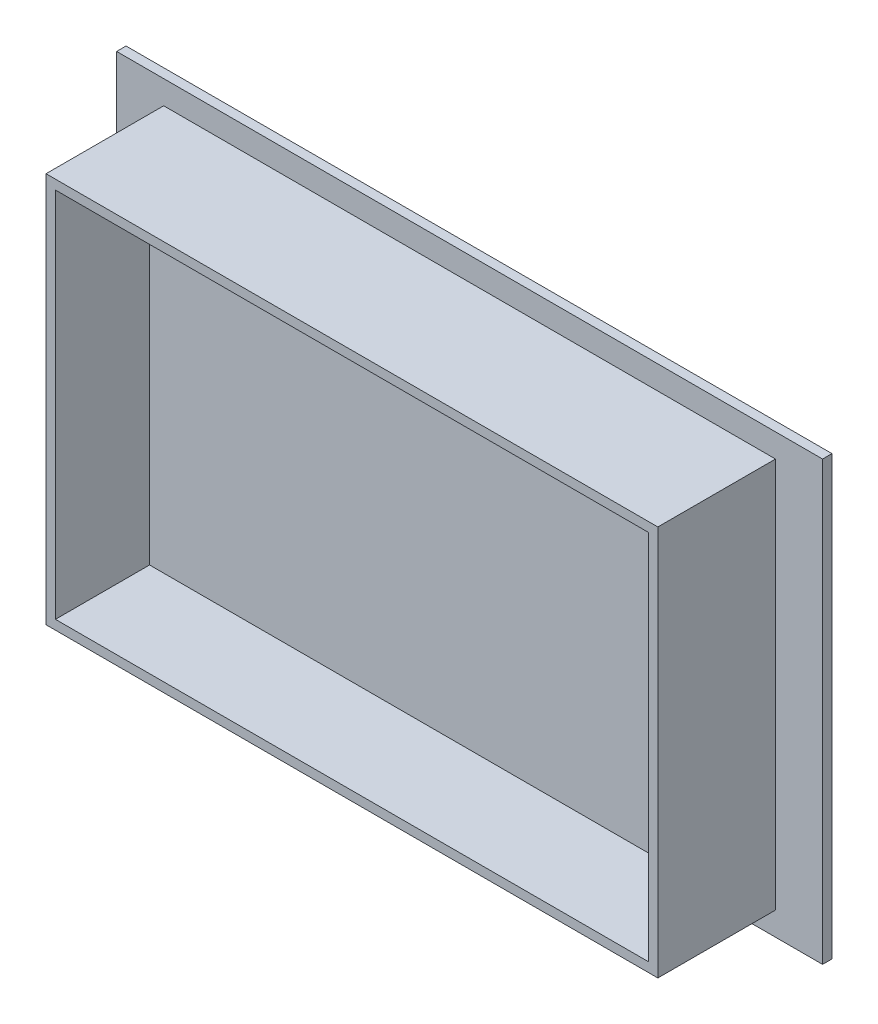
ISO-10303-21;
HEADER;
FILE_DESCRIPTION(('STEP AP214'),'2;1');
FILE_NAME('part.step','',(''),(''),'','','');
FILE_SCHEMA(('AUTOMOTIVE_DESIGN { 1 0 10303 214 1 1 1 1 }'));
ENDSEC;
DATA;
#1=APPLICATION_CONTEXT('core data for automotive mechanical design processes');
#2=APPLICATION_PROTOCOL_DEFINITION('international standard','automotive_design',2000,#1);
#3=PRODUCT_CONTEXT('',#1,'mechanical');
#4=PRODUCT('Part','Part','',(#3));
#5=PRODUCT_RELATED_PRODUCT_CATEGORY('part','',(#4));
#6=PRODUCT_DEFINITION_FORMATION('','',#4);
#7=PRODUCT_DEFINITION_CONTEXT('part definition',#1,'design');
#8=PRODUCT_DEFINITION('design','',#6,#7);
#9=PRODUCT_DEFINITION_SHAPE('','',#8);
#10=(LENGTH_UNIT() NAMED_UNIT(*) SI_UNIT(.MILLI.,.METRE.));
#11=(NAMED_UNIT(*) PLANE_ANGLE_UNIT() SI_UNIT($,.RADIAN.));
#12=(NAMED_UNIT(*) SI_UNIT($,.STERADIAN.) SOLID_ANGLE_UNIT());
#13=UNCERTAINTY_MEASURE_WITH_UNIT(LENGTH_MEASURE(1.E-05),#10,'distance_accuracy_value','');
#14=(GEOMETRIC_REPRESENTATION_CONTEXT(3) GLOBAL_UNCERTAINTY_ASSIGNED_CONTEXT((#13)) GLOBAL_UNIT_ASSIGNED_CONTEXT((#10,
#11,#12)) REPRESENTATION_CONTEXT('',''));
#15=CARTESIAN_POINT('',(0.,0.,0.));
#16=DIRECTION('',(0.,0.,1.));
#17=DIRECTION('',(1.,0.,0.));
#18=AXIS2_PLACEMENT_3D('',#15,#16,#17);
#19=CARTESIAN_POINT('',(-66.2133829920482,39.5262550380923,2.));
#20=DIRECTION('',(1.,0.,0.));
#21=DIRECTION('',(0.,1.,0.));
#22=AXIS2_PLACEMENT_3D('',#19,#20,#21);
#23=PLANE('',#22);
#24=DIRECTION('',(0.,-1.,0.));
#25=VECTOR('',#24,1.);
#26=CARTESIAN_POINT('',(-66.2133829920482,39.5262550380923,0.));
#27=LINE('',#26,#25);
#28=CARTESIAN_POINT('',(-66.2133829920482,39.5262550380923,0.));
#29=VERTEX_POINT('',#28);
#30=CARTESIAN_POINT('',(-66.2133829920482,-53.4737449619076,0.));
#31=VERTEX_POINT('',#30);
#32=EDGE_CURVE('E293',#29,#31,#27,.T.);
#33=ORIENTED_EDGE('',*,*,#32,.T.);
#34=DIRECTION('',(0.,0.,-1.));
#35=VECTOR('',#34,1.);
#36=CARTESIAN_POINT('',(-66.2133829920482,-53.4737449619076,2.));
#37=LINE('',#36,#35);
#38=CARTESIAN_POINT('',(-66.2133829920482,-53.4737449619076,2.));
#39=VERTEX_POINT('',#38);
#40=EDGE_CURVE('E11',#39,#31,#37,.T.);
#41=ORIENTED_EDGE('',*,*,#40,.F.);
#42=DIRECTION('',(0.,-1.,0.));
#43=VECTOR('',#42,1.);
#44=CARTESIAN_POINT('',(-66.2133829920482,39.5262550380923,2.));
#45=LINE('',#44,#43);
#46=CARTESIAN_POINT('',(-66.2133829920482,39.5262550380923,2.));
#47=VERTEX_POINT('',#46);
#48=EDGE_CURVE('E294',#47,#39,#45,.T.);
#49=ORIENTED_EDGE('',*,*,#48,.F.);
#50=DIRECTION('',(0.,0.,-1.));
#51=VECTOR('',#50,1.);
#52=CARTESIAN_POINT('',(-66.2133829920482,39.5262550380923,2.));
#53=LINE('',#52,#51);
#54=EDGE_CURVE('E308',#47,#29,#53,.T.);
#55=ORIENTED_EDGE('',*,*,#54,.T.);
#56=EDGE_LOOP('',(#33,#41,#49,#55));
#57=FACE_BOUND('',#56,.T.);
#58=ADVANCED_FACE('F43',(#57),#23,.F.);
#59=CARTESIAN_POINT('',(-66.2133829920482,-53.4737449619076,2.));
#60=DIRECTION('',(0.,1.,0.));
#61=DIRECTION('',(0.,0.,1.));
#62=AXIS2_PLACEMENT_3D('',#59,#60,#61);
#63=PLANE('',#62);
#64=DIRECTION('',(1.,0.,0.));
#65=VECTOR('',#64,1.);
#66=CARTESIAN_POINT('',(-66.2133829920482,-53.4737449619076,0.));
#67=LINE('',#66,#65);
#68=CARTESIAN_POINT('',(83.7866170079518,-53.4737449619076,0.));
#69=VERTEX_POINT('',#68);
#70=EDGE_CURVE('E312',#31,#69,#67,.T.);
#71=ORIENTED_EDGE('',*,*,#70,.T.);
#72=DIRECTION('',(0.,0.,-1.));
#73=VECTOR('',#72,1.);
#74=CARTESIAN_POINT('',(83.7866170079518,-53.4737449619076,2.));
#75=LINE('',#74,#73);
#76=CARTESIAN_POINT('',(83.7866170079518,-53.4737449619076,2.));
#77=VERTEX_POINT('',#76);
#78=EDGE_CURVE('E51',#77,#69,#75,.T.);
#79=ORIENTED_EDGE('',*,*,#78,.F.);
#80=DIRECTION('',(1.,0.,0.));
#81=VECTOR('',#80,1.);
#82=CARTESIAN_POINT('',(-66.2133829920482,-53.4737449619076,2.));
#83=LINE('',#82,#81);
#84=EDGE_CURVE('E298',#39,#77,#83,.T.);
#85=ORIENTED_EDGE('',*,*,#84,.F.);
#86=ORIENTED_EDGE('',*,*,#40,.T.);
#87=EDGE_LOOP('',(#71,#79,#85,#86));
#88=FACE_BOUND('',#87,.T.);
#89=ADVANCED_FACE('F348',(#88),#63,.F.);
#90=CARTESIAN_POINT('',(83.7866170079518,39.5262550380923,2.));
#91=DIRECTION('',(-1.,0.,0.));
#92=DIRECTION('',(0.,-1.,0.));
#93=AXIS2_PLACEMENT_3D('',#90,#91,#92);
#94=PLANE('',#93);
#95=DIRECTION('',(0.,1.,0.));
#96=VECTOR('',#95,1.);
#97=CARTESIAN_POINT('',(83.7866170079518,39.5262550380923,0.));
#98=LINE('',#97,#96);
#99=CARTESIAN_POINT('',(83.7866170079518,39.5262550380923,0.));
#100=VERTEX_POINT('',#99);
#101=EDGE_CURVE('E315',#69,#100,#98,.T.);
#102=ORIENTED_EDGE('',*,*,#101,.T.);
#103=DIRECTION('',(0.,0.,-1.));
#104=VECTOR('',#103,1.);
#105=CARTESIAN_POINT('',(83.7866170079518,39.5262550380923,2.));
#106=LINE('',#105,#104);
#107=CARTESIAN_POINT('',(83.7866170079518,39.5262550380923,2.));
#108=VERTEX_POINT('',#107);
#109=EDGE_CURVE('E323',#108,#100,#106,.T.);
#110=ORIENTED_EDGE('',*,*,#109,.F.);
#111=DIRECTION('',(0.,1.,0.));
#112=VECTOR('',#111,1.);
#113=CARTESIAN_POINT('',(83.7866170079518,39.5262550380923,2.));
#114=LINE('',#113,#112);
#115=EDGE_CURVE('E302',#77,#108,#114,.T.);
#116=ORIENTED_EDGE('',*,*,#115,.F.);
#117=ORIENTED_EDGE('',*,*,#78,.T.);
#118=EDGE_LOOP('',(#102,#110,#116,#117));
#119=FACE_BOUND('',#118,.T.);
#120=ADVANCED_FACE('F332',(#119),#94,.F.);
#121=CARTESIAN_POINT('',(-66.2133829920482,39.5262550380923,2.));
#122=DIRECTION('',(0.,-1.,0.));
#123=DIRECTION('',(0.,0.,-1.));
#124=AXIS2_PLACEMENT_3D('',#121,#122,#123);
#125=PLANE('',#124);
#126=DIRECTION('',(-1.,0.,0.));
#127=VECTOR('',#126,1.);
#128=CARTESIAN_POINT('',(-66.2133829920482,39.5262550380923,0.));
#129=LINE('',#128,#127);
#130=EDGE_CURVE('E299',#100,#29,#129,.T.);
#131=ORIENTED_EDGE('',*,*,#130,.T.);
#132=ORIENTED_EDGE('',*,*,#54,.F.);
#133=DIRECTION('',(-1.,0.,0.));
#134=VECTOR('',#133,1.);
#135=CARTESIAN_POINT('',(-66.2133829920482,39.5262550380923,2.));
#136=LINE('',#135,#134);
#137=EDGE_CURVE('E305',#108,#47,#136,.T.);
#138=ORIENTED_EDGE('',*,*,#137,.F.);
#139=ORIENTED_EDGE('',*,*,#109,.T.);
#140=EDGE_LOOP('',(#131,#132,#138,#139));
#141=FACE_BOUND('',#140,.T.);
#142=ADVANCED_FACE('F341',(#141),#125,.F.);
#143=CARTESIAN_POINT('',(0.,0.,2.));
#144=DIRECTION('',(0.,0.,1.));
#145=DIRECTION('',(1.,0.,0.));
#146=AXIS2_PLACEMENT_3D('',#143,#144,#145);
#147=PLANE('',#146);
#148=DIRECTION('',(0.,-1.,0.));
#149=VECTOR('',#148,1.);
#150=CARTESIAN_POINT('',(-56.2133829920482,34.5262550380923,2.));
#151=LINE('',#150,#149);
#152=CARTESIAN_POINT('',(-56.2133829920482,34.5262550380923,2.));
#153=VERTEX_POINT('',#152);
#154=CARTESIAN_POINT('',(-56.2133829920482,-48.4737449619077,2.));
#155=VERTEX_POINT('',#154);
#156=EDGE_CURVE('E240',#153,#155,#151,.T.);
#157=ORIENTED_EDGE('',*,*,#156,.F.);
#158=DIRECTION('',(-1.,0.,0.));
#159=VECTOR('',#158,1.);
#160=CARTESIAN_POINT('',(-56.2133829920482,34.5262550380923,2.));
#161=LINE('',#160,#159);
#162=CARTESIAN_POINT('',(73.7866170079518,34.5262550380923,2.));
#163=VERTEX_POINT('',#162);
#164=EDGE_CURVE('E254',#163,#153,#161,.T.);
#165=ORIENTED_EDGE('',*,*,#164,.F.);
#166=DIRECTION('',(0.,1.,0.));
#167=VECTOR('',#166,1.);
#168=CARTESIAN_POINT('',(73.7866170079518,34.5262550380923,2.));
#169=LINE('',#168,#167);
#170=CARTESIAN_POINT('',(73.7866170079518,-48.4737449619077,2.));
#171=VERTEX_POINT('',#170);
#172=EDGE_CURVE('E271',#171,#163,#169,.T.);
#173=ORIENTED_EDGE('',*,*,#172,.F.);
#174=DIRECTION('',(1.,0.,0.));
#175=VECTOR('',#174,1.);
#176=CARTESIAN_POINT('',(-56.2133829920482,-48.4737449619077,2.));
#177=LINE('',#176,#175);
#178=EDGE_CURVE('E267',#155,#171,#177,.T.);
#179=ORIENTED_EDGE('',*,*,#178,.F.);
#180=EDGE_LOOP('',(#157,#165,#173,#179));
#181=FACE_BOUND('',#180,.T.);
#182=ORIENTED_EDGE('',*,*,#48,.T.);
#183=ORIENTED_EDGE('',*,*,#84,.T.);
#184=ORIENTED_EDGE('',*,*,#115,.T.);
#185=ORIENTED_EDGE('',*,*,#137,.T.);
#186=EDGE_LOOP('',(#182,#183,#184,#185));
#187=FACE_BOUND('',#186,.T.);
#188=ADVANCED_FACE('F347',(#181,#187),#147,.T.);
#189=CARTESIAN_POINT('',(0.,0.,0.));
#190=DIRECTION('',(0.,0.,1.));
#191=DIRECTION('',(1.,0.,0.));
#192=AXIS2_PLACEMENT_3D('',#189,#190,#191);
#193=PLANE('',#192);
#194=DIRECTION('',(-1.,0.,0.));
#195=VECTOR('',#194,1.);
#196=CARTESIAN_POINT('',(71.7866170079518,-46.4737449619077,0.));
#197=LINE('',#196,#195);
#198=CARTESIAN_POINT('',(71.7866170079518,-46.4737449619077,0.));
#199=VERTEX_POINT('',#198);
#200=CARTESIAN_POINT('',(-54.2133829920482,-46.4737449619077,0.));
#201=VERTEX_POINT('',#200);
#202=EDGE_CURVE('E226',#199,#201,#197,.T.);
#203=ORIENTED_EDGE('',*,*,#202,.F.);
#204=DIRECTION('',(0.,-1.,0.));
#205=VECTOR('',#204,1.);
#206=CARTESIAN_POINT('',(71.7866170079518,32.5262550380923,0.));
#207=LINE('',#206,#205);
#208=CARTESIAN_POINT('',(71.7866170079518,32.5262550380923,0.));
#209=VERTEX_POINT('',#208);
#210=EDGE_CURVE('E66',#209,#199,#207,.T.);
#211=ORIENTED_EDGE('',*,*,#210,.F.);
#212=DIRECTION('',(1.,0.,0.));
#213=VECTOR('',#212,1.);
#214=CARTESIAN_POINT('',(71.7866170079518,32.5262550380923,0.));
#215=LINE('',#214,#213);
#216=CARTESIAN_POINT('',(-54.2133829920482,32.5262550380923,0.));
#217=VERTEX_POINT('',#216);
#218=EDGE_CURVE('E211',#217,#209,#215,.T.);
#219=ORIENTED_EDGE('',*,*,#218,.F.);
#220=DIRECTION('',(0.,1.,0.));
#221=VECTOR('',#220,1.);
#222=CARTESIAN_POINT('',(-54.2133829920482,32.5262550380923,0.));
#223=LINE('',#222,#221);
#224=EDGE_CURVE('E230',#201,#217,#223,.T.);
#225=ORIENTED_EDGE('',*,*,#224,.F.);
#226=EDGE_LOOP('',(#203,#211,#219,#225));
#227=FACE_BOUND('',#226,.T.);
#228=ORIENTED_EDGE('',*,*,#32,.F.);
#229=ORIENTED_EDGE('',*,*,#130,.F.);
#230=ORIENTED_EDGE('',*,*,#101,.F.);
#231=ORIENTED_EDGE('',*,*,#70,.F.);
#232=EDGE_LOOP('',(#228,#229,#230,#231));
#233=FACE_BOUND('',#232,.T.);
#234=ADVANCED_FACE('F338',(#227,#233),#193,.F.);
#235=CARTESIAN_POINT('',(-56.2133829920482,34.5262550380923,27.));
#236=DIRECTION('',(1.,0.,0.));
#237=DIRECTION('',(0.,0.,-1.));
#238=AXIS2_PLACEMENT_3D('',#235,#236,#237);
#239=PLANE('',#238);
#240=ORIENTED_EDGE('',*,*,#156,.T.);
#241=DIRECTION('',(0.,0.,-1.));
#242=VECTOR('',#241,1.);
#243=CARTESIAN_POINT('',(-56.2133829920482,-48.4737449619077,27.));
#244=LINE('',#243,#242);
#245=CARTESIAN_POINT('',(-56.2133829920482,-48.4737449619077,27.));
#246=VERTEX_POINT('',#245);
#247=EDGE_CURVE('E289',#246,#155,#244,.T.);
#248=ORIENTED_EDGE('',*,*,#247,.F.);
#249=DIRECTION('',(0.,-1.,0.));
#250=VECTOR('',#249,1.);
#251=CARTESIAN_POINT('',(-56.2133829920482,34.5262550380923,27.));
#252=LINE('',#251,#250);
#253=CARTESIAN_POINT('',(-56.2133829920482,34.5262550380923,27.));
#254=VERTEX_POINT('',#253);
#255=EDGE_CURVE('E249',#254,#246,#252,.T.);
#256=ORIENTED_EDGE('',*,*,#255,.F.);
#257=DIRECTION('',(0.,0.,-1.));
#258=VECTOR('',#257,1.);
#259=CARTESIAN_POINT('',(-56.2133829920482,34.5262550380923,27.));
#260=LINE('',#259,#258);
#261=EDGE_CURVE('E263',#254,#153,#260,.T.);
#262=ORIENTED_EDGE('',*,*,#261,.T.);
#263=EDGE_LOOP('',(#240,#248,#256,#262));
#264=FACE_BOUND('',#263,.T.);
#265=ADVANCED_FACE('F360',(#264),#239,.F.);
#266=CARTESIAN_POINT('',(-56.2133829920482,-48.4737449619077,27.));
#267=DIRECTION('',(0.,1.,0.));
#268=DIRECTION('',(0.,0.,1.));
#269=AXIS2_PLACEMENT_3D('',#266,#267,#268);
#270=PLANE('',#269);
#271=ORIENTED_EDGE('',*,*,#178,.T.);
#272=DIRECTION('',(0.,0.,-1.));
#273=VECTOR('',#272,1.);
#274=CARTESIAN_POINT('',(73.7866170079518,-48.4737449619077,27.));
#275=LINE('',#274,#273);
#276=CARTESIAN_POINT('',(73.7866170079518,-48.4737449619077,27.));
#277=VERTEX_POINT('',#276);
#278=EDGE_CURVE('E285',#277,#171,#275,.T.);
#279=ORIENTED_EDGE('',*,*,#278,.F.);
#280=DIRECTION('',(1.,0.,0.));
#281=VECTOR('',#280,1.);
#282=CARTESIAN_POINT('',(-56.2133829920482,-48.4737449619077,27.));
#283=LINE('',#282,#281);
#284=EDGE_CURVE('E253',#246,#277,#283,.T.);
#285=ORIENTED_EDGE('',*,*,#284,.F.);
#286=ORIENTED_EDGE('',*,*,#247,.T.);
#287=EDGE_LOOP('',(#271,#279,#285,#286));
#288=FACE_BOUND('',#287,.T.);
#289=ADVANCED_FACE('F367',(#288),#270,.F.);
#290=CARTESIAN_POINT('',(73.7866170079518,34.5262550380923,27.));
#291=DIRECTION('',(-1.,0.,0.));
#292=DIRECTION('',(0.,-1.,0.));
#293=AXIS2_PLACEMENT_3D('',#290,#291,#292);
#294=PLANE('',#293);
#295=ORIENTED_EDGE('',*,*,#172,.T.);
#296=DIRECTION('',(0.,0.,-1.));
#297=VECTOR('',#296,1.);
#298=CARTESIAN_POINT('',(73.7866170079518,34.5262550380923,27.));
#299=LINE('',#298,#297);
#300=CARTESIAN_POINT('',(73.7866170079518,34.5262550380923,27.));
#301=VERTEX_POINT('',#300);
#302=EDGE_CURVE('E281',#301,#163,#299,.T.);
#303=ORIENTED_EDGE('',*,*,#302,.F.);
#304=DIRECTION('',(0.,1.,0.));
#305=VECTOR('',#304,1.);
#306=CARTESIAN_POINT('',(73.7866170079518,34.5262550380923,27.));
#307=LINE('',#306,#305);
#308=EDGE_CURVE('E257',#277,#301,#307,.T.);
#309=ORIENTED_EDGE('',*,*,#308,.F.);
#310=ORIENTED_EDGE('',*,*,#278,.T.);
#311=EDGE_LOOP('',(#295,#303,#309,#310));
#312=FACE_BOUND('',#311,.T.);
#313=ADVANCED_FACE('F371',(#312),#294,.F.);
#314=CARTESIAN_POINT('',(-56.2133829920482,34.5262550380923,27.));
#315=DIRECTION('',(0.,-1.,0.));
#316=DIRECTION('',(0.,0.,-1.));
#317=AXIS2_PLACEMENT_3D('',#314,#315,#316);
#318=PLANE('',#317);
#319=ORIENTED_EDGE('',*,*,#164,.T.);
#320=ORIENTED_EDGE('',*,*,#261,.F.);
#321=DIRECTION('',(-1.,0.,0.));
#322=VECTOR('',#321,1.);
#323=CARTESIAN_POINT('',(-56.2133829920482,34.5262550380923,27.));
#324=LINE('',#323,#322);
#325=EDGE_CURVE('E260',#301,#254,#324,.T.);
#326=ORIENTED_EDGE('',*,*,#325,.F.);
#327=ORIENTED_EDGE('',*,*,#302,.T.);
#328=EDGE_LOOP('',(#319,#320,#326,#327));
#329=FACE_BOUND('',#328,.T.);
#330=ADVANCED_FACE('F375',(#329),#318,.F.);
#331=CARTESIAN_POINT('',(0.,0.,27.));
#332=DIRECTION('',(0.,0.,1.));
#333=DIRECTION('',(1.,0.,0.));
#334=AXIS2_PLACEMENT_3D('',#331,#332,#333);
#335=PLANE('',#334);
#336=DIRECTION('',(0.,-1.,0.));
#337=VECTOR('',#336,1.);
#338=CARTESIAN_POINT('',(-54.2133829920482,32.5262550380923,27.));
#339=LINE('',#338,#337);
#340=CARTESIAN_POINT('',(-54.2133829920482,32.5262550380923,27.));
#341=VERTEX_POINT('',#340);
#342=CARTESIAN_POINT('',(-54.2133829920482,-46.4737449619077,27.));
#343=VERTEX_POINT('',#342);
#344=EDGE_CURVE('E58',#341,#343,#339,.T.);
#345=ORIENTED_EDGE('',*,*,#344,.F.);
#346=DIRECTION('',(-1.,0.,0.));
#347=VECTOR('',#346,1.);
#348=CARTESIAN_POINT('',(-54.2133829920482,32.5262550380923,27.));
#349=LINE('',#348,#347);
#350=CARTESIAN_POINT('',(71.7866170079518,32.5262550380923,27.));
#351=VERTEX_POINT('',#350);
#352=EDGE_CURVE('E179',#351,#341,#349,.T.);
#353=ORIENTED_EDGE('',*,*,#352,.F.);
#354=DIRECTION('',(0.,1.,0.));
#355=VECTOR('',#354,1.);
#356=CARTESIAN_POINT('',(71.7866170079518,32.5262550380923,27.));
#357=LINE('',#356,#355);
#358=CARTESIAN_POINT('',(71.7866170079518,-46.4737449619077,27.));
#359=VERTEX_POINT('',#358);
#360=EDGE_CURVE('E183',#359,#351,#357,.T.);
#361=ORIENTED_EDGE('',*,*,#360,.F.);
#362=DIRECTION('',(1.,0.,0.));
#363=VECTOR('',#362,1.);
#364=CARTESIAN_POINT('',(-54.2133829920482,-46.4737449619077,27.));
#365=LINE('',#364,#363);
#366=EDGE_CURVE('E192',#343,#359,#365,.T.);
#367=ORIENTED_EDGE('',*,*,#366,.F.);
#368=EDGE_LOOP('',(#345,#353,#361,#367));
#369=FACE_BOUND('',#368,.T.);
#370=ORIENTED_EDGE('',*,*,#255,.T.);
#371=ORIENTED_EDGE('',*,*,#284,.T.);
#372=ORIENTED_EDGE('',*,*,#308,.T.);
#373=ORIENTED_EDGE('',*,*,#325,.T.);
#374=EDGE_LOOP('',(#370,#371,#372,#373));
#375=FACE_BOUND('',#374,.T.);
#376=ADVANCED_FACE('F379',(#369,#375),#335,.T.);
#377=CARTESIAN_POINT('',(71.7866170079518,32.5262550380923,2.));
#378=DIRECTION('',(1.,0.,0.));
#379=DIRECTION('',(0.,1.,0.));
#380=AXIS2_PLACEMENT_3D('',#377,#378,#379);
#381=PLANE('',#380);
#382=ORIENTED_EDGE('',*,*,#210,.T.);
#383=DIRECTION('',(0.,0.,-1.));
#384=VECTOR('',#383,1.);
#385=CARTESIAN_POINT('',(71.7866170079518,-46.4737449619077,2.));
#386=LINE('',#385,#384);
#387=CARTESIAN_POINT('',(71.7866170079518,-46.4737449619077,2.));
#388=VERTEX_POINT('',#387);
#389=EDGE_CURVE('E223',#388,#199,#386,.T.);
#390=ORIENTED_EDGE('',*,*,#389,.F.);
#391=DIRECTION('',(0.,-1.,0.));
#392=VECTOR('',#391,1.);
#393=CARTESIAN_POINT('',(71.7866170079518,32.5262550380923,2.));
#394=LINE('',#393,#392);
#395=CARTESIAN_POINT('',(71.7866170079518,32.5262550380923,2.));
#396=VERTEX_POINT('',#395);
#397=EDGE_CURVE('E206',#396,#388,#394,.T.);
#398=ORIENTED_EDGE('',*,*,#397,.F.);
#399=DIRECTION('',(0.,0.,-1.));
#400=VECTOR('',#399,1.);
#401=CARTESIAN_POINT('',(71.7866170079518,32.5262550380923,2.));
#402=LINE('',#401,#400);
#403=EDGE_CURVE('E237',#396,#209,#402,.T.);
#404=ORIENTED_EDGE('',*,*,#403,.T.);
#405=EDGE_LOOP('',(#382,#390,#398,#404));
#406=FACE_BOUND('',#405,.T.);
#407=ADVANCED_FACE('F383',(#406),#381,.F.);
#408=CARTESIAN_POINT('',(71.7866170079518,32.5262550380923,2.));
#409=DIRECTION('',(0.,1.,0.));
#410=DIRECTION('',(0.,0.,1.));
#411=AXIS2_PLACEMENT_3D('',#408,#409,#410);
#412=PLANE('',#411);
#413=ORIENTED_EDGE('',*,*,#218,.T.);
#414=ORIENTED_EDGE('',*,*,#403,.F.);
#415=DIRECTION('',(1.,0.,0.));
#416=VECTOR('',#415,1.);
#417=CARTESIAN_POINT('',(71.7866170079518,32.5262550380923,2.));
#418=LINE('',#417,#416);
#419=CARTESIAN_POINT('',(-54.2133829920482,32.5262550380923,2.));
#420=VERTEX_POINT('',#419);
#421=EDGE_CURVE('E219',#420,#396,#418,.T.);
#422=ORIENTED_EDGE('',*,*,#421,.F.);
#423=DIRECTION('',(0.,0.,-1.));
#424=VECTOR('',#423,1.);
#425=CARTESIAN_POINT('',(-54.2133829920482,32.5262550380923,2.));
#426=LINE('',#425,#424);
#427=EDGE_CURVE('E241',#420,#217,#426,.T.);
#428=ORIENTED_EDGE('',*,*,#427,.T.);
#429=EDGE_LOOP('',(#413,#414,#422,#428));
#430=FACE_BOUND('',#429,.T.);
#431=ADVANCED_FACE('F387',(#430),#412,.F.);
#432=CARTESIAN_POINT('',(-54.2133829920482,32.5262550380923,2.));
#433=DIRECTION('',(-1.,0.,0.));
#434=DIRECTION('',(0.,-1.,0.));
#435=AXIS2_PLACEMENT_3D('',#432,#433,#434);
#436=PLANE('',#435);
#437=ORIENTED_EDGE('',*,*,#224,.T.);
#438=ORIENTED_EDGE('',*,*,#427,.F.);
#439=DIRECTION('',(0.,1.,0.));
#440=VECTOR('',#439,1.);
#441=CARTESIAN_POINT('',(-54.2133829920482,32.5262550380923,2.));
#442=LINE('',#441,#440);
#443=CARTESIAN_POINT('',(-54.2133829920482,-46.4737449619077,2.));
#444=VERTEX_POINT('',#443);
#445=EDGE_CURVE('E215',#444,#420,#442,.T.);
#446=ORIENTED_EDGE('',*,*,#445,.F.);
#447=DIRECTION('',(0.,0.,-1.));
#448=VECTOR('',#447,1.);
#449=CARTESIAN_POINT('',(-54.2133829920482,-46.4737449619077,2.));
#450=LINE('',#449,#448);
#451=EDGE_CURVE('E244',#444,#201,#450,.T.);
#452=ORIENTED_EDGE('',*,*,#451,.T.);
#453=EDGE_LOOP('',(#437,#438,#446,#452));
#454=FACE_BOUND('',#453,.T.);
#455=ADVANCED_FACE('F392',(#454),#436,.F.);
#456=CARTESIAN_POINT('',(71.7866170079518,-46.4737449619077,2.));
#457=DIRECTION('',(0.,-1.,0.));
#458=DIRECTION('',(0.,0.,-1.));
#459=AXIS2_PLACEMENT_3D('',#456,#457,#458);
#460=PLANE('',#459);
#461=ORIENTED_EDGE('',*,*,#202,.T.);
#462=ORIENTED_EDGE('',*,*,#451,.F.);
#463=DIRECTION('',(-1.,0.,0.));
#464=VECTOR('',#463,1.);
#465=CARTESIAN_POINT('',(71.7866170079518,-46.4737449619077,2.));
#466=LINE('',#465,#464);
#467=EDGE_CURVE('E210',#388,#444,#466,.T.);
#468=ORIENTED_EDGE('',*,*,#467,.F.);
#469=ORIENTED_EDGE('',*,*,#389,.T.);
#470=EDGE_LOOP('',(#461,#462,#468,#469));
#471=FACE_BOUND('',#470,.T.);
#472=ADVANCED_FACE('F388',(#471),#460,.F.);
#473=CARTESIAN_POINT('',(0.,0.,2.));
#474=DIRECTION('',(0.,0.,-1.));
#475=DIRECTION('',(-1.,0.,0.));
#476=AXIS2_PLACEMENT_3D('',#473,#474,#475);
#477=PLANE('',#476);
#478=ORIENTED_EDGE('',*,*,#397,.T.);
#479=ORIENTED_EDGE('',*,*,#467,.T.);
#480=ORIENTED_EDGE('',*,*,#445,.T.);
#481=ORIENTED_EDGE('',*,*,#421,.T.);
#482=EDGE_LOOP('',(#478,#479,#480,#481));
#483=FACE_BOUND('',#482,.T.);
#484=ADVANCED_FACE('F391',(#483),#477,.T.);
#485=CARTESIAN_POINT('',(-54.2133829920482,32.5262550380923,7.));
#486=DIRECTION('',(-1.,0.,0.));
#487=DIRECTION('',(0.,0.,1.));
#488=AXIS2_PLACEMENT_3D('',#485,#486,#487);
#489=PLANE('',#488);
#490=ORIENTED_EDGE('',*,*,#344,.T.);
#491=DIRECTION('',(0.,0.,1.));
#492=VECTOR('',#491,1.);
#493=CARTESIAN_POINT('',(-54.2133829920482,-46.4737449619077,7.));
#494=LINE('',#493,#492);
#495=CARTESIAN_POINT('',(-54.2133829920482,-46.4737449619077,7.));
#496=VERTEX_POINT('',#495);
#497=EDGE_CURVE('E154',#496,#343,#494,.T.);
#498=ORIENTED_EDGE('',*,*,#497,.F.);
#499=DIRECTION('',(0.,-1.,0.));
#500=VECTOR('',#499,1.);
#501=CARTESIAN_POINT('',(-54.2133829920482,32.5262550380923,7.));
#502=LINE('',#501,#500);
#503=CARTESIAN_POINT('',(-54.2133829920482,32.5262550380923,7.));
#504=VERTEX_POINT('',#503);
#505=EDGE_CURVE('E158',#504,#496,#502,.T.);
#506=ORIENTED_EDGE('',*,*,#505,.F.);
#507=DIRECTION('',(0.,0.,1.));
#508=VECTOR('',#507,1.);
#509=CARTESIAN_POINT('',(-54.2133829920482,32.5262550380923,7.));
#510=LINE('',#509,#508);
#511=EDGE_CURVE('E198',#504,#341,#510,.T.);
#512=ORIENTED_EDGE('',*,*,#511,.T.);
#513=EDGE_LOOP('',(#490,#498,#506,#512));
#514=FACE_BOUND('',#513,.T.);
#515=ADVANCED_FACE('F156',(#514),#489,.F.);
#516=CARTESIAN_POINT('',(-54.2133829920482,32.5262550380923,7.));
#517=DIRECTION('',(0.,1.,0.));
#518=DIRECTION('',(0.,0.,1.));
#519=AXIS2_PLACEMENT_3D('',#516,#517,#518);
#520=PLANE('',#519);
#521=ORIENTED_EDGE('',*,*,#352,.T.);
#522=ORIENTED_EDGE('',*,*,#511,.F.);
#523=DIRECTION('',(-1.,0.,0.));
#524=VECTOR('',#523,1.);
#525=CARTESIAN_POINT('',(-54.2133829920482,32.5262550380923,7.));
#526=LINE('',#525,#524);
#527=CARTESIAN_POINT('',(71.7866170079518,32.5262550380923,7.));
#528=VERTEX_POINT('',#527);
#529=EDGE_CURVE('E165',#528,#504,#526,.T.);
#530=ORIENTED_EDGE('',*,*,#529,.F.);
#531=DIRECTION('',(0.,0.,1.));
#532=VECTOR('',#531,1.);
#533=CARTESIAN_POINT('',(71.7866170079518,32.5262550380923,7.));
#534=LINE('',#533,#532);
#535=EDGE_CURVE('E201',#528,#351,#534,.T.);
#536=ORIENTED_EDGE('',*,*,#535,.T.);
#537=EDGE_LOOP('',(#521,#522,#530,#536));
#538=FACE_BOUND('',#537,.T.);
#539=ADVANCED_FACE('F405',(#538),#520,.F.);
#540=CARTESIAN_POINT('',(71.7866170079518,32.5262550380923,7.));
#541=DIRECTION('',(1.,0.,0.));
#542=DIRECTION('',(0.,0.,-1.));
#543=AXIS2_PLACEMENT_3D('',#540,#541,#542);
#544=PLANE('',#543);
#545=ORIENTED_EDGE('',*,*,#360,.T.);
#546=ORIENTED_EDGE('',*,*,#535,.F.);
#547=DIRECTION('',(0.,1.,0.));
#548=VECTOR('',#547,1.);
#549=CARTESIAN_POINT('',(71.7866170079518,32.5262550380923,7.));
#550=LINE('',#549,#548);
#551=CARTESIAN_POINT('',(71.7866170079518,-46.4737449619077,7.));
#552=VERTEX_POINT('',#551);
#553=EDGE_CURVE('E174',#552,#528,#550,.T.);
#554=ORIENTED_EDGE('',*,*,#553,.F.);
#555=DIRECTION('',(0.,0.,1.));
#556=VECTOR('',#555,1.);
#557=CARTESIAN_POINT('',(71.7866170079518,-46.4737449619077,7.));
#558=LINE('',#557,#556);
#559=EDGE_CURVE('E164',#552,#359,#558,.T.);
#560=ORIENTED_EDGE('',*,*,#559,.T.);
#561=EDGE_LOOP('',(#545,#546,#554,#560));
#562=FACE_BOUND('',#561,.T.);
#563=ADVANCED_FACE('F408',(#562),#544,.F.);
#564=CARTESIAN_POINT('',(-54.2133829920482,-46.4737449619077,7.));
#565=DIRECTION('',(0.,-1.,0.));
#566=DIRECTION('',(0.,0.,-1.));
#567=AXIS2_PLACEMENT_3D('',#564,#565,#566);
#568=PLANE('',#567);
#569=ORIENTED_EDGE('',*,*,#366,.T.);
#570=ORIENTED_EDGE('',*,*,#559,.F.);
#571=DIRECTION('',(1.,0.,0.));
#572=VECTOR('',#571,1.);
#573=CARTESIAN_POINT('',(-54.2133829920482,-46.4737449619077,7.));
#574=LINE('',#573,#572);
#575=EDGE_CURVE('E168',#496,#552,#574,.T.);
#576=ORIENTED_EDGE('',*,*,#575,.F.);
#577=ORIENTED_EDGE('',*,*,#497,.T.);
#578=EDGE_LOOP('',(#569,#570,#576,#577));
#579=FACE_BOUND('',#578,.T.);
#580=ADVANCED_FACE('F169',(#579),#568,.F.);
#581=CARTESIAN_POINT('',(0.,0.,7.));
#582=DIRECTION('',(0.,0.,1.));
#583=DIRECTION('',(1.,0.,0.));
#584=AXIS2_PLACEMENT_3D('',#581,#582,#583);
#585=PLANE('',#584);
#586=ORIENTED_EDGE('',*,*,#505,.T.);
#587=ORIENTED_EDGE('',*,*,#575,.T.);
#588=ORIENTED_EDGE('',*,*,#553,.T.);
#589=ORIENTED_EDGE('',*,*,#529,.T.);
#590=EDGE_LOOP('',(#586,#587,#588,#589));
#591=FACE_BOUND('',#590,.T.);
#592=ADVANCED_FACE('F176',(#591),#585,.T.);
#593=CLOSED_SHELL('',(#58,#89,#120,#142,#188,#234,#265,#289,#313,#330,#376,#407,#431,#455,#472,
#484,#515,#539,#563,#580,#592));
#594=MANIFOLD_SOLID_BREP('B2',#593);
#595=ADVANCED_BREP_SHAPE_REPRESENTATION('',(#18,#594),#14);
#596=SHAPE_DEFINITION_REPRESENTATION(#9,#595);
ENDSEC;
END-ISO-10303-21;
